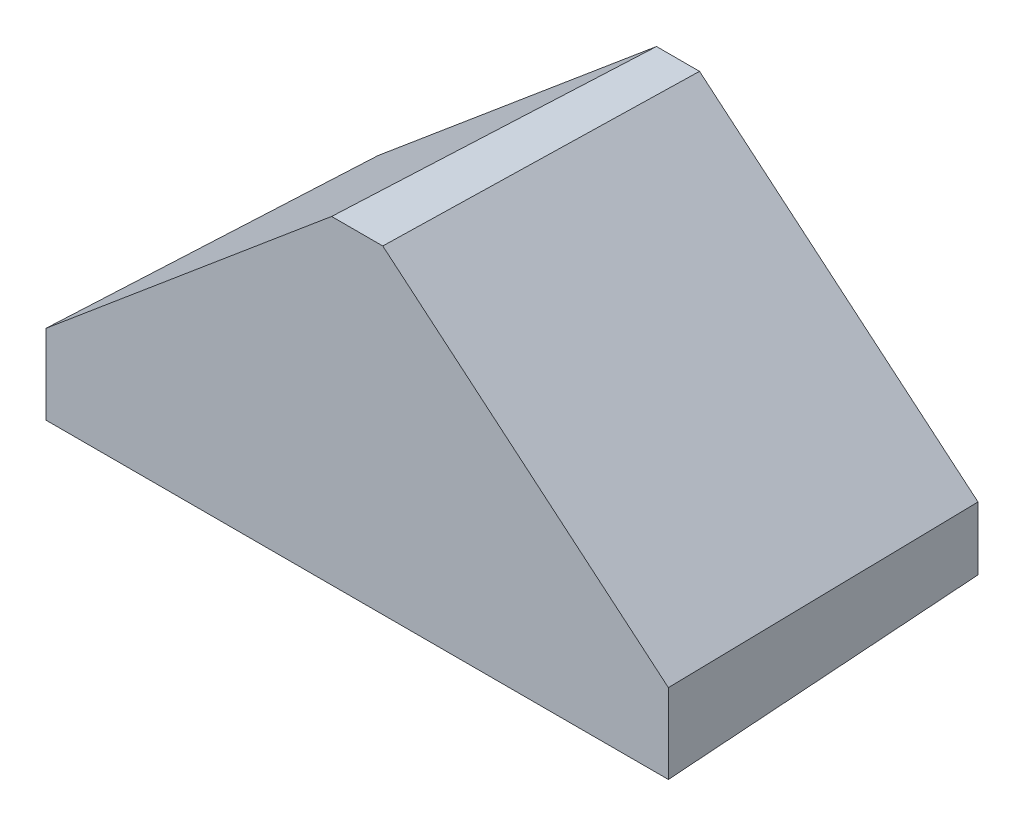
ISO-10303-21;
HEADER;
FILE_DESCRIPTION(('STEP AP214'),'2;1');
FILE_NAME('part.step','',(''),(''),'','','');
FILE_SCHEMA(('AUTOMOTIVE_DESIGN { 1 0 10303 214 1 1 1 1 }'));
ENDSEC;
DATA;
#1=APPLICATION_CONTEXT('core data for automotive mechanical design processes');
#2=APPLICATION_PROTOCOL_DEFINITION('international standard','automotive_design',2000,#1);
#3=PRODUCT_CONTEXT('',#1,'mechanical');
#4=PRODUCT('Part','Part','',(#3));
#5=PRODUCT_RELATED_PRODUCT_CATEGORY('part','',(#4));
#6=PRODUCT_DEFINITION_FORMATION('','',#4);
#7=PRODUCT_DEFINITION_CONTEXT('part definition',#1,'design');
#8=PRODUCT_DEFINITION('design','',#6,#7);
#9=PRODUCT_DEFINITION_SHAPE('','',#8);
#10=(LENGTH_UNIT() NAMED_UNIT(*) SI_UNIT(.MILLI.,.METRE.));
#11=(NAMED_UNIT(*) PLANE_ANGLE_UNIT() SI_UNIT($,.RADIAN.));
#12=(NAMED_UNIT(*) SI_UNIT($,.STERADIAN.) SOLID_ANGLE_UNIT());
#13=UNCERTAINTY_MEASURE_WITH_UNIT(LENGTH_MEASURE(1.E-05),#10,'distance_accuracy_value','');
#14=(GEOMETRIC_REPRESENTATION_CONTEXT(3) GLOBAL_UNCERTAINTY_ASSIGNED_CONTEXT((#13)) GLOBAL_UNIT_ASSIGNED_CONTEXT((#10,
#11,#12)) REPRESENTATION_CONTEXT('',''));
#15=CARTESIAN_POINT('',(0.,0.,0.));
#16=DIRECTION('',(0.,0.,1.));
#17=DIRECTION('',(1.,0.,0.));
#18=AXIS2_PLACEMENT_3D('',#15,#16,#17);
#19=CARTESIAN_POINT('',(0.,0.,0.));
#20=DIRECTION('',(0.,-0.999390827019096,-0.034899496702501));
#21=DIRECTION('',(0.,0.034899496702501,-0.999390827019096));
#22=AXIS2_PLACEMENT_3D('',#19,#20,#21);
#23=PLANE('',#22);
#24=DIRECTION('',(1.,0.,0.));
#25=VECTOR('',#24,1.);
#26=CARTESIAN_POINT('',(0.,0.,0.));
#27=LINE('',#26,#25);
#28=CARTESIAN_POINT('',(0.,0.,0.));
#29=VERTEX_POINT('',#28);
#30=CARTESIAN_POINT('',(95.,0.,0.));
#31=VERTEX_POINT('',#30);
#32=EDGE_CURVE('E102',#29,#31,#27,.T.);
#33=ORIENTED_EDGE('',*,*,#32,.T.);
#34=DIRECTION('',(-0.0348782627423747,0.0348782627423747,-0.998782765958718));
#35=VECTOR('',#34,1.);
#36=CARTESIAN_POINT('',(94.9878350678807,0.0121649321192623,-0.348358077336639));
#37=LINE('',#36,#35);
#38=CARTESIAN_POINT('',(96.7739750901808,-1.77397509018079,50.8));
#39=VERTEX_POINT('',#38);
#40=EDGE_CURVE('E11',#39,#31,#37,.T.);
#41=ORIENTED_EDGE('',*,*,#40,.F.);
#42=DIRECTION('',(-1.,0.,0.));
#43=VECTOR('',#42,1.);
#44=CARTESIAN_POINT('',(0.,-1.77397509018079,50.8));
#45=LINE('',#44,#43);
#46=CARTESIAN_POINT('',(-1.77397509018079,-1.77397509018079,50.8));
#47=VERTEX_POINT('',#46);
#48=EDGE_CURVE('E130',#47,#39,#45,.F.);
#49=ORIENTED_EDGE('',*,*,#48,.F.);
#50=DIRECTION('',(0.0348782627423747,0.0348782627423747,-0.998782765958718));
#51=VECTOR('',#50,1.);
#52=CARTESIAN_POINT('',(0.,0.,0.));
#53=LINE('',#52,#51);
#54=EDGE_CURVE('E115',#47,#29,#53,.T.);
#55=ORIENTED_EDGE('',*,*,#54,.T.);
#56=EDGE_LOOP('',(#33,#41,#49,#55));
#57=FACE_BOUND('',#56,.T.);
#58=ADVANCED_FACE('F43',(#57),#23,.T.);
#59=CARTESIAN_POINT('',(95.,10.,0.));
#60=DIRECTION('',(0.999390827019096,0.,-0.034899496702501));
#61=DIRECTION('',(-0.034899496702501,0.,-0.999390827019096));
#62=AXIS2_PLACEMENT_3D('',#59,#60,#61);
#63=PLANE('',#62);
#64=DIRECTION('',(0.,1.,0.));
#65=VECTOR('',#64,1.);
#66=CARTESIAN_POINT('',(95.,10.,0.));
#67=LINE('',#66,#65);
#68=CARTESIAN_POINT('',(95.,10.,0.));
#69=VERTEX_POINT('',#68);
#70=EDGE_CURVE('E98',#31,#69,#67,.T.);
#71=ORIENTED_EDGE('',*,*,#70,.T.);
#72=DIRECTION('',(-0.0348948762305471,-0.0162717480166752,-0.999258514013935));
#73=VECTOR('',#72,1.);
#74=CARTESIAN_POINT('',(94.9673163839688,9.98475937954849,-0.935936306869408));
#75=LINE('',#74,#73);
#76=CARTESIAN_POINT('',(96.7739750901808,10.8272181699275,50.8));
#77=VERTEX_POINT('',#76);
#78=EDGE_CURVE('E53',#77,#69,#75,.T.);
#79=ORIENTED_EDGE('',*,*,#78,.F.);
#80=DIRECTION('',(0.,-1.,0.));
#81=VECTOR('',#80,1.);
#82=CARTESIAN_POINT('',(96.7739750901808,0.,50.8));
#83=LINE('',#82,#81);
#84=EDGE_CURVE('E111',#39,#77,#83,.F.);
#85=ORIENTED_EDGE('',*,*,#84,.F.);
#86=ORIENTED_EDGE('',*,*,#40,.T.);
#87=EDGE_LOOP('',(#71,#79,#85,#86));
#88=FACE_BOUND('',#87,.T.);
#89=ADVANCED_FACE('F45',(#88),#63,.T.);
#90=CARTESIAN_POINT('',(50.9051170740131,47.,0.));
#91=DIRECTION('',(0.642396040842249,0.765577789542066,-0.034899496702501));
#92=DIRECTION('',(-0.766044443118986,0.64278760968653,0.));
#93=AXIS2_PLACEMENT_3D('',#90,#91,#92);
#94=PLANE('',#93);
#95=DIRECTION('',(-0.766044443118986,0.64278760968653,0.));
#96=VECTOR('',#95,1.);
#97=CARTESIAN_POINT('',(50.9051170740131,47.,0.));
#98=LINE('',#97,#96);
#99=CARTESIAN_POINT('',(50.9051170740131,47.,0.));
#100=VERTEX_POINT('',#99);
#101=EDGE_CURVE('E104',#69,#100,#98,.T.);
#102=ORIENTED_EDGE('',*,*,#101,.T.);
#103=DIRECTION('',(-0.012701353347648,-0.0348966815191779,-0.999310210716416));
#104=VECTOR('',#103,1.);
#105=CARTESIAN_POINT('',(50.9040184172329,46.9969814653046,-0.0864395240798123));
#106=LINE('',#105,#104);
#107=CARTESIAN_POINT('',(51.5507912031686,48.7739750901808,50.8));
#108=VERTEX_POINT('',#107);
#109=EDGE_CURVE('E142',#108,#100,#106,.T.);
#110=ORIENTED_EDGE('',*,*,#109,.F.);
#111=DIRECTION('',(0.766044443118986,-0.64278760968653,0.));
#112=VECTOR('',#111,1.);
#113=CARTESIAN_POINT('',(45.3160395337414,54.005552916479,50.8));
#114=LINE('',#113,#112);
#115=EDGE_CURVE('E152',#77,#108,#114,.F.);
#116=ORIENTED_EDGE('',*,*,#115,.F.);
#117=ORIENTED_EDGE('',*,*,#78,.T.);
#118=EDGE_LOOP('',(#102,#110,#116,#117));
#119=FACE_BOUND('',#118,.T.);
#120=ADVANCED_FACE('F189',(#119),#94,.T.);
#121=CARTESIAN_POINT('',(44.0948829259856,47.,0.));
#122=DIRECTION('',(0.,0.999390827019096,-0.034899496702501));
#123=DIRECTION('',(0.,0.0348994967025011,0.999390827019096));
#124=AXIS2_PLACEMENT_3D('',#121,#122,#123);
#125=PLANE('',#124);
#126=DIRECTION('',(-1.,0.,0.));
#127=VECTOR('',#126,1.);
#128=CARTESIAN_POINT('',(44.0948829259856,47.,0.));
#129=LINE('',#128,#127);
#130=CARTESIAN_POINT('',(44.0948829259856,47.,0.));
#131=VERTEX_POINT('',#130);
#132=EDGE_CURVE('E122',#100,#131,#129,.T.);
#133=ORIENTED_EDGE('',*,*,#132,.T.);
#134=DIRECTION('',(0.0127013533476483,-0.0348966815191779,-0.999310210716416));
#135=VECTOR('',#134,1.);
#136=CARTESIAN_POINT('',(44.1041690445323,46.9744865989786,-0.730608213757001));
#137=LINE('',#136,#135);
#138=CARTESIAN_POINT('',(43.4492087968301,48.7739750901808,50.8));
#139=VERTEX_POINT('',#138);
#140=EDGE_CURVE('E138',#139,#131,#137,.T.);
#141=ORIENTED_EDGE('',*,*,#140,.F.);
#142=DIRECTION('',(1.,0.,0.));
#143=VECTOR('',#142,1.);
#144=CARTESIAN_POINT('',(0.,48.7739750901808,50.8));
#145=LINE('',#144,#143);
#146=EDGE_CURVE('E155',#108,#139,#145,.F.);
#147=ORIENTED_EDGE('',*,*,#146,.F.);
#148=ORIENTED_EDGE('',*,*,#109,.T.);
#149=EDGE_LOOP('',(#133,#141,#147,#148));
#150=FACE_BOUND('',#149,.T.);
#151=ADVANCED_FACE('F182',(#150),#125,.T.);
#152=CARTESIAN_POINT('',(0.,10.,0.));
#153=DIRECTION('',(-0.64239604084226,0.765577789542057,-0.034899496702501));
#154=DIRECTION('',(-0.766044443118977,-0.642787609686541,0.));
#155=AXIS2_PLACEMENT_3D('',#152,#153,#154);
#156=PLANE('',#155);
#157=DIRECTION('',(-0.766044443118977,-0.642787609686541,0.));
#158=VECTOR('',#157,1.);
#159=CARTESIAN_POINT('',(0.,10.,0.));
#160=LINE('',#159,#158);
#161=CARTESIAN_POINT('',(0.,10.,0.));
#162=VERTEX_POINT('',#161);
#163=EDGE_CURVE('E125',#131,#162,#160,.T.);
#164=ORIENTED_EDGE('',*,*,#163,.T.);
#165=DIRECTION('',(0.034894876230547,-0.0162717480166749,-0.999258514013935));
#166=VECTOR('',#165,1.);
#167=CARTESIAN_POINT('',(0.00567800633096519,9.99735230216482,-0.162596827435517));
#168=LINE('',#167,#166);
#169=CARTESIAN_POINT('',(-1.77397509018079,10.8272181699275,50.8));
#170=VERTEX_POINT('',#169);
#171=EDGE_CURVE('E134',#170,#162,#168,.T.);
#172=ORIENTED_EDGE('',*,*,#171,.F.);
#173=DIRECTION('',(0.766044443118977,0.642787609686541,0.));
#174=VECTOR('',#173,1.);
#175=CARTESIAN_POINT('',(-6.06432797292182,7.22718464839911,50.8));
#176=LINE('',#175,#174);
#177=EDGE_CURVE('E65',#139,#170,#176,.F.);
#178=ORIENTED_EDGE('',*,*,#177,.F.);
#179=ORIENTED_EDGE('',*,*,#140,.T.);
#180=EDGE_LOOP('',(#164,#172,#178,#179));
#181=FACE_BOUND('',#180,.T.);
#182=ADVANCED_FACE('F185',(#181),#156,.T.);
#183=CARTESIAN_POINT('',(0.,0.,0.));
#184=DIRECTION('',(-0.999390827019096,0.,-0.034899496702501));
#185=DIRECTION('',(-0.034899496702501,0.,0.999390827019096));
#186=AXIS2_PLACEMENT_3D('',#183,#184,#185);
#187=PLANE('',#186);
#188=DIRECTION('',(0.,-1.,0.));
#189=VECTOR('',#188,1.);
#190=CARTESIAN_POINT('',(0.,0.,0.));
#191=LINE('',#190,#189);
#192=EDGE_CURVE('E128',#162,#29,#191,.T.);
#193=ORIENTED_EDGE('',*,*,#192,.T.);
#194=ORIENTED_EDGE('',*,*,#54,.F.);
#195=DIRECTION('',(0.,1.,0.));
#196=VECTOR('',#195,1.);
#197=CARTESIAN_POINT('',(-1.77397509018079,0.,50.8));
#198=LINE('',#197,#196);
#199=EDGE_CURVE('E47',#170,#47,#198,.F.);
#200=ORIENTED_EDGE('',*,*,#199,.F.);
#201=ORIENTED_EDGE('',*,*,#171,.T.);
#202=EDGE_LOOP('',(#193,#194,#200,#201));
#203=FACE_BOUND('',#202,.T.);
#204=ADVANCED_FACE('F187',(#203),#187,.T.);
#205=CARTESIAN_POINT('',(0.,0.,50.8));
#206=DIRECTION('',(0.,0.,-1.));
#207=DIRECTION('',(-1.,0.,0.));
#208=AXIS2_PLACEMENT_3D('',#205,#206,#207);
#209=PLANE('',#208);
#210=ORIENTED_EDGE('',*,*,#48,.T.);
#211=ORIENTED_EDGE('',*,*,#84,.T.);
#212=ORIENTED_EDGE('',*,*,#115,.T.);
#213=ORIENTED_EDGE('',*,*,#146,.T.);
#214=ORIENTED_EDGE('',*,*,#177,.T.);
#215=ORIENTED_EDGE('',*,*,#199,.T.);
#216=EDGE_LOOP('',(#210,#211,#212,#213,#214,#215));
#217=FACE_BOUND('',#216,.T.);
#218=ADVANCED_FACE('F178',(#217),#209,.F.);
#219=CARTESIAN_POINT('',(0.,0.,0.));
#220=DIRECTION('',(0.,0.,-1.));
#221=DIRECTION('',(-1.,0.,0.));
#222=AXIS2_PLACEMENT_3D('',#219,#220,#221);
#223=PLANE('',#222);
#224=ORIENTED_EDGE('',*,*,#32,.F.);
#225=ORIENTED_EDGE('',*,*,#192,.F.);
#226=ORIENTED_EDGE('',*,*,#163,.F.);
#227=ORIENTED_EDGE('',*,*,#132,.F.);
#228=ORIENTED_EDGE('',*,*,#101,.F.);
#229=ORIENTED_EDGE('',*,*,#70,.F.);
#230=EDGE_LOOP('',(#224,#225,#226,#227,#228,#229));
#231=FACE_BOUND('',#230,.T.);
#232=ADVANCED_FACE('F99',(#231),#223,.T.);
#233=CLOSED_SHELL('',(#58,#89,#120,#151,#182,#204,#218,#232));
#234=MANIFOLD_SOLID_BREP('B2',#233);
#235=ADVANCED_BREP_SHAPE_REPRESENTATION('',(#18,#234),#14);
#236=SHAPE_DEFINITION_REPRESENTATION(#9,#235);
ENDSEC;
END-ISO-10303-21;
